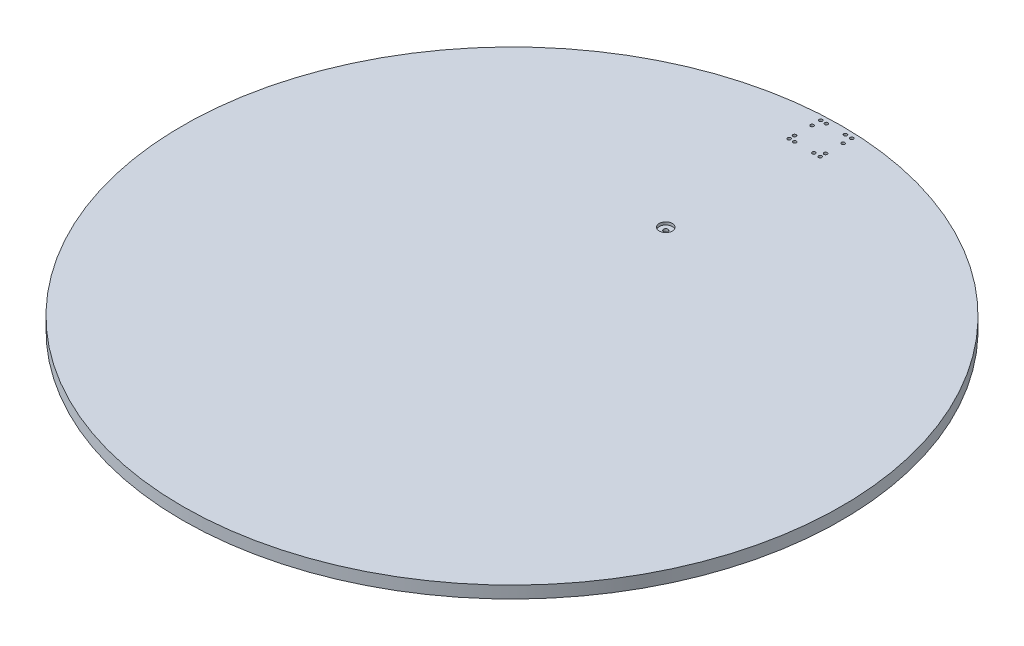
ISO-10303-21;
HEADER;
FILE_DESCRIPTION(('STEP AP214'),'2;1');
FILE_NAME('part.step','',(''),(''),'','','');
FILE_SCHEMA(('AUTOMOTIVE_DESIGN { 1 0 10303 214 1 1 1 1 }'));
ENDSEC;
DATA;
#1=APPLICATION_CONTEXT('core data for automotive mechanical design processes');
#2=APPLICATION_PROTOCOL_DEFINITION('international standard','automotive_design',2000,#1);
#3=PRODUCT_CONTEXT('',#1,'mechanical');
#4=PRODUCT('Part','Part','',(#3));
#5=PRODUCT_RELATED_PRODUCT_CATEGORY('part','',(#4));
#6=PRODUCT_DEFINITION_FORMATION('','',#4);
#7=PRODUCT_DEFINITION_CONTEXT('part definition',#1,'design');
#8=PRODUCT_DEFINITION('design','',#6,#7);
#9=PRODUCT_DEFINITION_SHAPE('','',#8);
#10=(LENGTH_UNIT() NAMED_UNIT(*) SI_UNIT(.MILLI.,.METRE.));
#11=(NAMED_UNIT(*) PLANE_ANGLE_UNIT() SI_UNIT($,.RADIAN.));
#12=(NAMED_UNIT(*) SI_UNIT($,.STERADIAN.) SOLID_ANGLE_UNIT());
#13=UNCERTAINTY_MEASURE_WITH_UNIT(LENGTH_MEASURE(1.E-05),#10,'distance_accuracy_value','');
#14=(GEOMETRIC_REPRESENTATION_CONTEXT(3) GLOBAL_UNCERTAINTY_ASSIGNED_CONTEXT((#13)) GLOBAL_UNIT_ASSIGNED_CONTEXT((#10,
#11,#12)) REPRESENTATION_CONTEXT('',''));
#15=CARTESIAN_POINT('',(0.,0.,0.));
#16=DIRECTION('',(0.,0.,1.));
#17=DIRECTION('',(1.,0.,0.));
#18=AXIS2_PLACEMENT_3D('',#15,#16,#17);
#19=CARTESIAN_POINT('',(1.28563826251593E-10,0.,-280.));
#20=DIRECTION('',(0.,1.,0.));
#21=DIRECTION('',(0.,0.,1.));
#22=AXIS2_PLACEMENT_3D('',#19,#20,#21);
#23=CYLINDRICAL_SURFACE('',#22,3.99999999999999);
#24=CARTESIAN_POINT('',(1.28563826251593E-10,8.,-280.));
#25=DIRECTION('',(0.,-1.,0.));
#26=DIRECTION('',(0.,0.,-1.));
#27=AXIS2_PLACEMENT_3D('',#24,#25,#26);
#28=CIRCLE('',#27,3.99999999999999);
#29=CARTESIAN_POINT('',(1.28563826251593E-10,8.,-284.));
#30=VERTEX_POINT('',#29);
#31=EDGE_CURVE('E133',#30,#30,#28,.F.);
#32=ORIENTED_EDGE('',*,*,#31,.F.);
#33=EDGE_LOOP('',(#32));
#34=FACE_BOUND('',#33,.T.);
#35=CARTESIAN_POINT('',(1.28563826251593E-10,17.,-280.));
#36=DIRECTION('',(0.,1.,0.));
#37=DIRECTION('',(0.,0.,1.));
#38=AXIS2_PLACEMENT_3D('',#35,#36,#37);
#39=CIRCLE('',#38,3.99999999999999);
#40=CARTESIAN_POINT('',(1.28563826251593E-10,17.,-276.));
#41=VERTEX_POINT('',#40);
#42=EDGE_CURVE('E37',#41,#41,#39,.F.);
#43=ORIENTED_EDGE('',*,*,#42,.F.);
#44=EDGE_LOOP('',(#43));
#45=FACE_BOUND('',#44,.T.);
#46=ADVANCED_FACE('F33',(#34,#45),#23,.F.);
#47=CARTESIAN_POINT('',(0.,22.,0.));
#48=DIRECTION('',(0.,-1.,0.));
#49=DIRECTION('',(0.,0.,-1.));
#50=AXIS2_PLACEMENT_3D('',#47,#48,#49);
#51=CYLINDRICAL_SURFACE('',#50,600.);
#52=CARTESIAN_POINT('',(0.,22.,0.));
#53=DIRECTION('',(0.,1.,0.));
#54=DIRECTION('',(0.,0.,1.));
#55=AXIS2_PLACEMENT_3D('',#52,#53,#54);
#56=CIRCLE('',#55,600.);
#57=CARTESIAN_POINT('',(0.,22.,600.));
#58=VERTEX_POINT('',#57);
#59=EDGE_CURVE('E11',#58,#58,#56,.T.);
#60=ORIENTED_EDGE('',*,*,#59,.F.);
#61=EDGE_LOOP('',(#60));
#62=FACE_BOUND('',#61,.T.);
#63=CARTESIAN_POINT('',(0.,0.,0.));
#64=DIRECTION('',(0.,1.,0.));
#65=DIRECTION('',(0.,0.,1.));
#66=AXIS2_PLACEMENT_3D('',#63,#64,#65);
#67=CIRCLE('',#66,600.);
#68=CARTESIAN_POINT('',(0.,0.,600.));
#69=VERTEX_POINT('',#68);
#70=EDGE_CURVE('E42',#69,#69,#67,.T.);
#71=ORIENTED_EDGE('',*,*,#70,.T.);
#72=EDGE_LOOP('',(#71));
#73=FACE_BOUND('',#72,.T.);
#74=ADVANCED_FACE('F35',(#62,#73),#51,.T.);
#75=CARTESIAN_POINT('',(0.,22.,0.));
#76=DIRECTION('',(0.,1.,0.));
#77=DIRECTION('',(0.,0.,1.));
#78=AXIS2_PLACEMENT_3D('',#75,#76,#77);
#79=PLANE('',#78);
#80=CARTESIAN_POINT('',(17.5875772330869,22.,-531.883070045424));
#81=DIRECTION('',(0.,1.,0.));
#82=DIRECTION('',(0.,0.,1.));
#83=AXIS2_PLACEMENT_3D('',#80,#81,#82);
#84=CIRCLE('',#83,3.);
#85=CARTESIAN_POINT('',(17.5875772330869,22.,-528.883070045424));
#86=VERTEX_POINT('',#85);
#87=EDGE_CURVE('E295',#86,#86,#84,.T.);
#88=ORIENTED_EDGE('',*,*,#87,.F.);
#89=EDGE_LOOP('',(#88));
#90=FACE_BOUND('',#89,.T.);
#91=CARTESIAN_POINT('',(29.1360242602252,22.,-531.883070045424));
#92=DIRECTION('',(0.,1.,0.));
#93=DIRECTION('',(0.,0.,1.));
#94=AXIS2_PLACEMENT_3D('',#91,#92,#93);
#95=CIRCLE('',#94,3.);
#96=CARTESIAN_POINT('',(29.1360242602252,22.,-528.883070045424));
#97=VERTEX_POINT('',#96);
#98=EDGE_CURVE('E291',#97,#97,#95,.T.);
#99=ORIENTED_EDGE('',*,*,#98,.F.);
#100=EDGE_LOOP('',(#99));
#101=FACE_BOUND('',#100,.T.);
#102=CARTESIAN_POINT('',(29.1360242602252,22.,-541.773153337076));
#103=DIRECTION('',(0.,1.,0.));
#104=DIRECTION('',(0.,0.,1.));
#105=AXIS2_PLACEMENT_3D('',#102,#103,#104);
#106=CIRCLE('',#105,3.);
#107=CARTESIAN_POINT('',(29.1360242602252,22.,-538.773153337076));
#108=VERTEX_POINT('',#107);
#109=EDGE_CURVE('E287',#108,#108,#106,.T.);
#110=ORIENTED_EDGE('',*,*,#109,.F.);
#111=EDGE_LOOP('',(#110));
#112=FACE_BOUND('',#111,.T.);
#113=CARTESIAN_POINT('',(29.1360242602252,22.,-573.664786381322));
#114=DIRECTION('',(0.,1.,0.));
#115=DIRECTION('',(0.,0.,1.));
#116=AXIS2_PLACEMENT_3D('',#113,#114,#115);
#117=CIRCLE('',#116,3.);
#118=CARTESIAN_POINT('',(29.1360242602252,22.,-570.664786381322));
#119=VERTEX_POINT('',#118);
#120=EDGE_CURVE('E283',#119,#119,#117,.T.);
#121=ORIENTED_EDGE('',*,*,#120,.F.);
#122=EDGE_LOOP('',(#121));
#123=FACE_BOUND('',#122,.T.);
#124=CARTESIAN_POINT('',(29.1360242602252,22.,-589.516341352475));
#125=DIRECTION('',(0.,1.,0.));
#126=DIRECTION('',(0.,0.,1.));
#127=AXIS2_PLACEMENT_3D('',#124,#125,#126);
#128=CIRCLE('',#127,3.);
#129=CARTESIAN_POINT('',(29.1360242602252,22.,-586.516341352475));
#130=VERTEX_POINT('',#129);
#131=EDGE_CURVE('E279',#130,#130,#128,.T.);
#132=ORIENTED_EDGE('',*,*,#131,.F.);
#133=EDGE_LOOP('',(#132));
#134=FACE_BOUND('',#133,.T.);
#135=CARTESIAN_POINT('',(17.5875772330869,22.,-589.516341352475));
#136=DIRECTION('',(0.,1.,0.));
#137=DIRECTION('',(0.,0.,1.));
#138=AXIS2_PLACEMENT_3D('',#135,#136,#137);
#139=CIRCLE('',#138,3.);
#140=CARTESIAN_POINT('',(17.5875772330869,22.,-586.516341352475));
#141=VERTEX_POINT('',#140);
#142=EDGE_CURVE('E275',#141,#141,#139,.T.);
#143=ORIENTED_EDGE('',*,*,#142,.F.);
#144=EDGE_LOOP('',(#143));
#145=FACE_BOUND('',#144,.T.);
#146=CARTESIAN_POINT('',(-17.3384223424247,22.,-589.516341352475));
#147=DIRECTION('',(0.,1.,0.));
#148=DIRECTION('',(0.,0.,1.));
#149=AXIS2_PLACEMENT_3D('',#146,#147,#148);
#150=CIRCLE('',#149,3.);
#151=CARTESIAN_POINT('',(-17.3384223424247,22.,-586.516341352475));
#152=VERTEX_POINT('',#151);
#153=EDGE_CURVE('E271',#152,#152,#150,.T.);
#154=ORIENTED_EDGE('',*,*,#153,.F.);
#155=EDGE_LOOP('',(#154));
#156=FACE_BOUND('',#155,.T.);
#157=CARTESIAN_POINT('',(-27.3597077913434,22.,-573.664786381322));
#158=DIRECTION('',(0.,1.,0.));
#159=DIRECTION('',(0.,0.,1.));
#160=AXIS2_PLACEMENT_3D('',#157,#158,#159);
#161=CIRCLE('',#160,3.);
#162=CARTESIAN_POINT('',(-27.3597077913434,22.,-570.664786381322));
#163=VERTEX_POINT('',#162);
#164=EDGE_CURVE('E267',#163,#163,#161,.T.);
#165=ORIENTED_EDGE('',*,*,#164,.F.);
#166=EDGE_LOOP('',(#165));
#167=FACE_BOUND('',#166,.T.);
#168=CARTESIAN_POINT('',(-27.3597077913434,22.,-589.516341352475));
#169=DIRECTION('',(0.,1.,0.));
#170=DIRECTION('',(0.,0.,1.));
#171=AXIS2_PLACEMENT_3D('',#168,#169,#170);
#172=CIRCLE('',#171,3.);
#173=CARTESIAN_POINT('',(-27.3597077913434,22.,-586.516341352475));
#174=VERTEX_POINT('',#173);
#175=EDGE_CURVE('E263',#174,#174,#172,.T.);
#176=ORIENTED_EDGE('',*,*,#175,.F.);
#177=EDGE_LOOP('',(#176));
#178=FACE_BOUND('',#177,.T.);
#179=CARTESIAN_POINT('',(-17.3384223424247,22.,-531.883070045424));
#180=DIRECTION('',(0.,1.,0.));
#181=DIRECTION('',(0.,0.,1.));
#182=AXIS2_PLACEMENT_3D('',#179,#180,#181);
#183=CIRCLE('',#182,3.);
#184=CARTESIAN_POINT('',(-17.3384223424247,22.,-528.883070045424));
#185=VERTEX_POINT('',#184);
#186=EDGE_CURVE('E259',#185,#185,#183,.T.);
#187=ORIENTED_EDGE('',*,*,#186,.F.);
#188=EDGE_LOOP('',(#187));
#189=FACE_BOUND('',#188,.T.);
#190=CARTESIAN_POINT('',(-27.3597077913434,22.,-531.883070045424));
#191=DIRECTION('',(0.,1.,0.));
#192=DIRECTION('',(0.,0.,1.));
#193=AXIS2_PLACEMENT_3D('',#190,#191,#192);
#194=CIRCLE('',#193,3.);
#195=CARTESIAN_POINT('',(-27.3597077913434,22.,-528.883070045424));
#196=VERTEX_POINT('',#195);
#197=EDGE_CURVE('E255',#196,#196,#194,.T.);
#198=ORIENTED_EDGE('',*,*,#197,.F.);
#199=EDGE_LOOP('',(#198));
#200=FACE_BOUND('',#199,.T.);
#201=CARTESIAN_POINT('',(-27.3597077913434,22.,-541.773153337076));
#202=DIRECTION('',(0.,1.,0.));
#203=DIRECTION('',(0.,0.,1.));
#204=AXIS2_PLACEMENT_3D('',#201,#202,#203);
#205=CIRCLE('',#204,3.);
#206=CARTESIAN_POINT('',(-27.3597077913434,22.,-538.773153337076));
#207=VERTEX_POINT('',#206);
#208=EDGE_CURVE('E159',#207,#207,#205,.T.);
#209=ORIENTED_EDGE('',*,*,#208,.F.);
#210=EDGE_LOOP('',(#209));
#211=FACE_BOUND('',#210,.T.);
#212=CARTESIAN_POINT('',(1.2756462552943E-10,22.,-280.));
#213=DIRECTION('',(0.,1.,0.));
#214=DIRECTION('',(0.,0.,1.));
#215=AXIS2_PLACEMENT_3D('',#212,#213,#214);
#216=CIRCLE('',#215,12.);
#217=CARTESIAN_POINT('',(1.2756462552943E-10,22.,-268.));
#218=VERTEX_POINT('',#217);
#219=EDGE_CURVE('E151',#218,#218,#216,.T.);
#220=ORIENTED_EDGE('',*,*,#219,.F.);
#221=EDGE_LOOP('',(#220));
#222=FACE_BOUND('',#221,.T.);
#223=ORIENTED_EDGE('',*,*,#59,.T.);
#224=EDGE_LOOP('',(#223));
#225=FACE_BOUND('',#224,.T.);
#226=ADVANCED_FACE('F198',(#90,#101,#112,#123,#134,#145,#156,#167,#178,#189,#200,#211,#222,
#225),#79,.T.);
#227=CARTESIAN_POINT('',(0.,0.,0.));
#228=DIRECTION('',(0.,1.,0.));
#229=DIRECTION('',(0.,0.,1.));
#230=AXIS2_PLACEMENT_3D('',#227,#228,#229);
#231=PLANE('',#230);
#232=CARTESIAN_POINT('',(17.5875772330869,0.,-531.883070045424));
#233=DIRECTION('',(0.,1.,0.));
#234=DIRECTION('',(0.,0.,1.));
#235=AXIS2_PLACEMENT_3D('',#232,#233,#234);
#236=CIRCLE('',#235,3.);
#237=CARTESIAN_POINT('',(17.5875772330869,0.,-528.883070045424));
#238=VERTEX_POINT('',#237);
#239=EDGE_CURVE('E209',#238,#238,#236,.T.);
#240=ORIENTED_EDGE('',*,*,#239,.T.);
#241=EDGE_LOOP('',(#240));
#242=FACE_BOUND('',#241,.T.);
#243=CARTESIAN_POINT('',(29.1360242602252,0.,-531.883070045424));
#244=DIRECTION('',(0.,1.,0.));
#245=DIRECTION('',(0.,0.,1.));
#246=AXIS2_PLACEMENT_3D('',#243,#244,#245);
#247=CIRCLE('',#246,3.);
#248=CARTESIAN_POINT('',(29.1360242602252,0.,-528.883070045424));
#249=VERTEX_POINT('',#248);
#250=EDGE_CURVE('E213',#249,#249,#247,.T.);
#251=ORIENTED_EDGE('',*,*,#250,.T.);
#252=EDGE_LOOP('',(#251));
#253=FACE_BOUND('',#252,.T.);
#254=CARTESIAN_POINT('',(29.1360242602252,0.,-541.773153337076));
#255=DIRECTION('',(0.,1.,0.));
#256=DIRECTION('',(0.,0.,1.));
#257=AXIS2_PLACEMENT_3D('',#254,#255,#256);
#258=CIRCLE('',#257,3.);
#259=CARTESIAN_POINT('',(29.1360242602252,0.,-538.773153337076));
#260=VERTEX_POINT('',#259);
#261=EDGE_CURVE('E217',#260,#260,#258,.T.);
#262=ORIENTED_EDGE('',*,*,#261,.T.);
#263=EDGE_LOOP('',(#262));
#264=FACE_BOUND('',#263,.T.);
#265=CARTESIAN_POINT('',(29.1360242602252,0.,-573.664786381322));
#266=DIRECTION('',(0.,1.,0.));
#267=DIRECTION('',(0.,0.,1.));
#268=AXIS2_PLACEMENT_3D('',#265,#266,#267);
#269=CIRCLE('',#268,3.);
#270=CARTESIAN_POINT('',(29.1360242602252,0.,-570.664786381322));
#271=VERTEX_POINT('',#270);
#272=EDGE_CURVE('E221',#271,#271,#269,.T.);
#273=ORIENTED_EDGE('',*,*,#272,.T.);
#274=EDGE_LOOP('',(#273));
#275=FACE_BOUND('',#274,.T.);
#276=CARTESIAN_POINT('',(29.1360242602252,0.,-589.516341352475));
#277=DIRECTION('',(0.,1.,0.));
#278=DIRECTION('',(0.,0.,1.));
#279=AXIS2_PLACEMENT_3D('',#276,#277,#278);
#280=CIRCLE('',#279,3.);
#281=CARTESIAN_POINT('',(29.1360242602252,0.,-586.516341352475));
#282=VERTEX_POINT('',#281);
#283=EDGE_CURVE('E225',#282,#282,#280,.T.);
#284=ORIENTED_EDGE('',*,*,#283,.T.);
#285=EDGE_LOOP('',(#284));
#286=FACE_BOUND('',#285,.T.);
#287=CARTESIAN_POINT('',(17.5875772330869,0.,-589.516341352475));
#288=DIRECTION('',(0.,1.,0.));
#289=DIRECTION('',(0.,0.,1.));
#290=AXIS2_PLACEMENT_3D('',#287,#288,#289);
#291=CIRCLE('',#290,3.);
#292=CARTESIAN_POINT('',(17.5875772330869,0.,-586.516341352475));
#293=VERTEX_POINT('',#292);
#294=EDGE_CURVE('E229',#293,#293,#291,.T.);
#295=ORIENTED_EDGE('',*,*,#294,.T.);
#296=EDGE_LOOP('',(#295));
#297=FACE_BOUND('',#296,.T.);
#298=CARTESIAN_POINT('',(-17.3384223424247,0.,-589.516341352475));
#299=DIRECTION('',(0.,1.,0.));
#300=DIRECTION('',(0.,0.,1.));
#301=AXIS2_PLACEMENT_3D('',#298,#299,#300);
#302=CIRCLE('',#301,3.);
#303=CARTESIAN_POINT('',(-17.3384223424247,0.,-586.516341352475));
#304=VERTEX_POINT('',#303);
#305=EDGE_CURVE('E233',#304,#304,#302,.T.);
#306=ORIENTED_EDGE('',*,*,#305,.T.);
#307=EDGE_LOOP('',(#306));
#308=FACE_BOUND('',#307,.T.);
#309=CARTESIAN_POINT('',(-27.3597077913434,0.,-573.664786381322));
#310=DIRECTION('',(0.,1.,0.));
#311=DIRECTION('',(0.,0.,1.));
#312=AXIS2_PLACEMENT_3D('',#309,#310,#311);
#313=CIRCLE('',#312,3.);
#314=CARTESIAN_POINT('',(-27.3597077913434,0.,-570.664786381322));
#315=VERTEX_POINT('',#314);
#316=EDGE_CURVE('E237',#315,#315,#313,.T.);
#317=ORIENTED_EDGE('',*,*,#316,.T.);
#318=EDGE_LOOP('',(#317));
#319=FACE_BOUND('',#318,.T.);
#320=CARTESIAN_POINT('',(-27.3597077913434,0.,-589.516341352475));
#321=DIRECTION('',(0.,1.,0.));
#322=DIRECTION('',(0.,0.,1.));
#323=AXIS2_PLACEMENT_3D('',#320,#321,#322);
#324=CIRCLE('',#323,3.);
#325=CARTESIAN_POINT('',(-27.3597077913434,0.,-586.516341352475));
#326=VERTEX_POINT('',#325);
#327=EDGE_CURVE('E241',#326,#326,#324,.T.);
#328=ORIENTED_EDGE('',*,*,#327,.T.);
#329=EDGE_LOOP('',(#328));
#330=FACE_BOUND('',#329,.T.);
#331=CARTESIAN_POINT('',(-17.3384223424247,0.,-531.883070045424));
#332=DIRECTION('',(0.,1.,0.));
#333=DIRECTION('',(0.,0.,1.));
#334=AXIS2_PLACEMENT_3D('',#331,#332,#333);
#335=CIRCLE('',#334,3.);
#336=CARTESIAN_POINT('',(-17.3384223424247,0.,-528.883070045424));
#337=VERTEX_POINT('',#336);
#338=EDGE_CURVE('E245',#337,#337,#335,.T.);
#339=ORIENTED_EDGE('',*,*,#338,.T.);
#340=EDGE_LOOP('',(#339));
#341=FACE_BOUND('',#340,.T.);
#342=CARTESIAN_POINT('',(-27.3597077913434,0.,-531.883070045424));
#343=DIRECTION('',(0.,1.,0.));
#344=DIRECTION('',(0.,0.,1.));
#345=AXIS2_PLACEMENT_3D('',#342,#343,#344);
#346=CIRCLE('',#345,3.);
#347=CARTESIAN_POINT('',(-27.3597077913434,0.,-528.883070045424));
#348=VERTEX_POINT('',#347);
#349=EDGE_CURVE('E249',#348,#348,#346,.T.);
#350=ORIENTED_EDGE('',*,*,#349,.T.);
#351=EDGE_LOOP('',(#350));
#352=FACE_BOUND('',#351,.T.);
#353=CARTESIAN_POINT('',(-27.3597077913434,0.,-541.773153337076));
#354=DIRECTION('',(0.,1.,0.));
#355=DIRECTION('',(0.,0.,1.));
#356=AXIS2_PLACEMENT_3D('',#353,#354,#355);
#357=CIRCLE('',#356,3.);
#358=CARTESIAN_POINT('',(-27.3597077913434,0.,-538.773153337076));
#359=VERTEX_POINT('',#358);
#360=EDGE_CURVE('E156',#359,#359,#357,.T.);
#361=ORIENTED_EDGE('',*,*,#360,.T.);
#362=EDGE_LOOP('',(#361));
#363=FACE_BOUND('',#362,.T.);
#364=DIRECTION('',(0.,0.,1.));
#365=VECTOR('',#364,1.);
#366=CARTESIAN_POINT('',(6.50000000012851,0.,-280.));
#367=LINE('',#366,#365);
#368=CARTESIAN_POINT('',(6.50000000012851,0.,-283.752776749733));
#369=VERTEX_POINT('',#368);
#370=CARTESIAN_POINT('',(6.50000000012851,0.,-276.247223250267));
#371=VERTEX_POINT('',#370);
#372=EDGE_CURVE('E118',#369,#371,#367,.T.);
#373=ORIENTED_EDGE('',*,*,#372,.F.);
#374=DIRECTION('',(0.866025403784441,0.,0.499999999999996));
#375=VECTOR('',#374,1.);
#376=CARTESIAN_POINT('',(3.25000000012843,0.,-285.629165124599));
#377=LINE('',#376,#375);
#378=CARTESIAN_POINT('',(1.28452803949131E-10,0.,-287.505553499465));
#379=VERTEX_POINT('',#378);
#380=EDGE_CURVE('E50',#379,#369,#377,.T.);
#381=ORIENTED_EDGE('',*,*,#380,.F.);
#382=DIRECTION('',(0.86602540378444,0.,-0.499999999999997));
#383=VECTOR('',#382,1.);
#384=CARTESIAN_POINT('',(-3.24999999987152,0.,-285.629165124599));
#385=LINE('',#384,#383);
#386=CARTESIAN_POINT('',(-6.49999999987155,0.,-283.752776749733));
#387=VERTEX_POINT('',#386);
#388=EDGE_CURVE('E128',#387,#379,#385,.T.);
#389=ORIENTED_EDGE('',*,*,#388,.F.);
#390=DIRECTION('',(0.,0.,-1.));
#391=VECTOR('',#390,1.);
#392=CARTESIAN_POINT('',(-6.49999999987155,0.,-280.));
#393=LINE('',#392,#391);
#394=CARTESIAN_POINT('',(-6.49999999987155,0.,-276.247223250267));
#395=VERTEX_POINT('',#394);
#396=EDGE_CURVE('E107',#395,#387,#393,.T.);
#397=ORIENTED_EDGE('',*,*,#396,.F.);
#398=DIRECTION('',(-0.866025403784437,0.,-0.500000000000002));
#399=VECTOR('',#398,1.);
#400=CARTESIAN_POINT('',(-3.24999999987152,0.,-274.370834875401));
#401=LINE('',#400,#399);
#402=CARTESIAN_POINT('',(1.28452803949131E-10,0.,-272.494446500535));
#403=VERTEX_POINT('',#402);
#404=EDGE_CURVE('E124',#403,#395,#401,.T.);
#405=ORIENTED_EDGE('',*,*,#404,.F.);
#406=DIRECTION('',(-0.86602540378444,0.,0.499999999999997));
#407=VECTOR('',#406,1.);
#408=CARTESIAN_POINT('',(3.25000000012843,0.,-274.370834875401));
#409=LINE('',#408,#407);
#410=EDGE_CURVE('E121',#371,#403,#409,.T.);
#411=ORIENTED_EDGE('',*,*,#410,.F.);
#412=EDGE_LOOP('',(#373,#381,#389,#397,#405,#411));
#413=FACE_BOUND('',#412,.T.);
#414=ORIENTED_EDGE('',*,*,#70,.F.);
#415=EDGE_LOOP('',(#414));
#416=FACE_BOUND('',#415,.T.);
#417=ADVANCED_FACE('F174',(#242,#253,#264,#275,#286,#297,#308,#319,#330,#341,#352,#363,#413,
#416),#231,.F.);
#418=CARTESIAN_POINT('',(0.,8.,0.));
#419=DIRECTION('',(0.,-1.,0.));
#420=DIRECTION('',(0.,0.,-1.));
#421=AXIS2_PLACEMENT_3D('',#418,#419,#420);
#422=PLANE('',#421);
#423=DIRECTION('',(0.,0.,1.));
#424=VECTOR('',#423,1.);
#425=CARTESIAN_POINT('',(6.50000000012851,8.,-283.752776749733));
#426=LINE('',#425,#424);
#427=CARTESIAN_POINT('',(6.50000000012851,8.,-283.752776749733));
#428=VERTEX_POINT('',#427);
#429=CARTESIAN_POINT('',(6.50000000012851,8.,-276.247223250267));
#430=VERTEX_POINT('',#429);
#431=EDGE_CURVE('E84',#428,#430,#426,.T.);
#432=ORIENTED_EDGE('',*,*,#431,.T.);
#433=DIRECTION('',(-0.866025403784441,0.,0.499999999999996));
#434=VECTOR('',#433,1.);
#435=CARTESIAN_POINT('',(6.50000000012851,8.,-276.247223250267));
#436=LINE('',#435,#434);
#437=CARTESIAN_POINT('',(1.28452803949131E-10,8.,-272.494446500535));
#438=VERTEX_POINT('',#437);
#439=EDGE_CURVE('E163',#430,#438,#436,.T.);
#440=ORIENTED_EDGE('',*,*,#439,.T.);
#441=DIRECTION('',(-0.86602540378444,0.,-0.499999999999997));
#442=VECTOR('',#441,1.);
#443=CARTESIAN_POINT('',(1.28452803949131E-10,8.,-272.494446500535));
#444=LINE('',#443,#442);
#445=CARTESIAN_POINT('',(-6.49999999987155,8.,-276.247223250267));
#446=VERTEX_POINT('',#445);
#447=EDGE_CURVE('E99',#438,#446,#444,.T.);
#448=ORIENTED_EDGE('',*,*,#447,.T.);
#449=DIRECTION('',(0.,0.,-1.));
#450=VECTOR('',#449,1.);
#451=CARTESIAN_POINT('',(-6.49999999987155,8.,-276.247223250267));
#452=LINE('',#451,#450);
#453=CARTESIAN_POINT('',(-6.49999999987155,8.,-283.752776749733));
#454=VERTEX_POINT('',#453);
#455=EDGE_CURVE('E92',#446,#454,#452,.T.);
#456=ORIENTED_EDGE('',*,*,#455,.T.);
#457=DIRECTION('',(0.866025403784437,0.,-0.500000000000002));
#458=VECTOR('',#457,1.);
#459=CARTESIAN_POINT('',(-6.49999999987155,8.,-283.752776749733));
#460=LINE('',#459,#458);
#461=CARTESIAN_POINT('',(1.28452803949131E-10,8.,-287.505553499465));
#462=VERTEX_POINT('',#461);
#463=EDGE_CURVE('E97',#454,#462,#460,.T.);
#464=ORIENTED_EDGE('',*,*,#463,.T.);
#465=DIRECTION('',(0.86602540378444,0.,0.499999999999997));
#466=VECTOR('',#465,1.);
#467=CARTESIAN_POINT('',(1.28452803949131E-10,8.,-287.505553499465));
#468=LINE('',#467,#466);
#469=EDGE_CURVE('E59',#462,#428,#468,.T.);
#470=ORIENTED_EDGE('',*,*,#469,.T.);
#471=EDGE_LOOP('',(#432,#440,#448,#456,#464,#470));
#472=FACE_BOUND('',#471,.T.);
#473=ORIENTED_EDGE('',*,*,#31,.T.);
#474=EDGE_LOOP('',(#473));
#475=FACE_BOUND('',#474,.T.);
#476=ADVANCED_FACE('F94',(#472,#475),#422,.T.);
#477=CARTESIAN_POINT('',(3.25000000012843,8.,-285.629165124599));
#478=DIRECTION('',(0.499999999999996,0.,-0.866025403784441));
#479=DIRECTION('',(-0.866025403784441,0.,-0.499999999999996));
#480=AXIS2_PLACEMENT_3D('',#477,#478,#479);
#481=PLANE('',#480);
#482=ORIENTED_EDGE('',*,*,#380,.T.);
#483=DIRECTION('',(0.,-1.,0.));
#484=VECTOR('',#483,1.);
#485=CARTESIAN_POINT('',(6.50000000012851,8.,-283.752776749733));
#486=LINE('',#485,#484);
#487=EDGE_CURVE('E131',#428,#369,#486,.T.);
#488=ORIENTED_EDGE('',*,*,#487,.F.);
#489=ORIENTED_EDGE('',*,*,#469,.F.);
#490=DIRECTION('',(0.,-1.,0.));
#491=VECTOR('',#490,1.);
#492=CARTESIAN_POINT('',(1.28452803949131E-10,8.,-287.505553499465));
#493=LINE('',#492,#491);
#494=EDGE_CURVE('E78',#462,#379,#493,.T.);
#495=ORIENTED_EDGE('',*,*,#494,.T.);
#496=EDGE_LOOP('',(#482,#488,#489,#495));
#497=FACE_BOUND('',#496,.T.);
#498=ADVANCED_FACE('F178',(#497),#481,.F.);
#499=CARTESIAN_POINT('',(-3.24999999987152,8.,-285.629165124599));
#500=DIRECTION('',(-0.499999999999997,0.,-0.86602540378444));
#501=DIRECTION('',(-0.86602540378444,0.,0.499999999999997));
#502=AXIS2_PLACEMENT_3D('',#499,#500,#501);
#503=PLANE('',#502);
#504=ORIENTED_EDGE('',*,*,#388,.T.);
#505=ORIENTED_EDGE('',*,*,#494,.F.);
#506=ORIENTED_EDGE('',*,*,#463,.F.);
#507=DIRECTION('',(0.,-1.,0.));
#508=VECTOR('',#507,1.);
#509=CARTESIAN_POINT('',(-6.49999999987155,8.,-283.752776749733));
#510=LINE('',#509,#508);
#511=EDGE_CURVE('E104',#454,#387,#510,.T.);
#512=ORIENTED_EDGE('',*,*,#511,.T.);
#513=EDGE_LOOP('',(#504,#505,#506,#512));
#514=FACE_BOUND('',#513,.T.);
#515=ADVANCED_FACE('F112',(#514),#503,.F.);
#516=CARTESIAN_POINT('',(-6.49999999987155,8.,-280.));
#517=DIRECTION('',(-1.,0.,0.));
#518=DIRECTION('',(0.,0.,1.));
#519=AXIS2_PLACEMENT_3D('',#516,#517,#518);
#520=PLANE('',#519);
#521=ORIENTED_EDGE('',*,*,#396,.T.);
#522=ORIENTED_EDGE('',*,*,#511,.F.);
#523=ORIENTED_EDGE('',*,*,#455,.F.);
#524=DIRECTION('',(0.,-1.,0.));
#525=VECTOR('',#524,1.);
#526=CARTESIAN_POINT('',(-6.49999999987155,8.,-276.247223250267));
#527=LINE('',#526,#525);
#528=EDGE_CURVE('E110',#446,#395,#527,.T.);
#529=ORIENTED_EDGE('',*,*,#528,.T.);
#530=EDGE_LOOP('',(#521,#522,#523,#529));
#531=FACE_BOUND('',#530,.T.);
#532=ADVANCED_FACE('F105',(#531),#520,.F.);
#533=CARTESIAN_POINT('',(-3.24999999987152,8.,-274.370834875401));
#534=DIRECTION('',(-0.500000000000002,0.,0.866025403784438));
#535=DIRECTION('',(0.866025403784437,0.,0.500000000000002));
#536=AXIS2_PLACEMENT_3D('',#533,#534,#535);
#537=PLANE('',#536);
#538=ORIENTED_EDGE('',*,*,#404,.T.);
#539=ORIENTED_EDGE('',*,*,#528,.F.);
#540=ORIENTED_EDGE('',*,*,#447,.F.);
#541=DIRECTION('',(0.,-1.,0.));
#542=VECTOR('',#541,1.);
#543=CARTESIAN_POINT('',(1.28452803949131E-10,8.,-272.494446500535));
#544=LINE('',#543,#542);
#545=EDGE_CURVE('E136',#438,#403,#544,.T.);
#546=ORIENTED_EDGE('',*,*,#545,.T.);
#547=EDGE_LOOP('',(#538,#539,#540,#546));
#548=FACE_BOUND('',#547,.T.);
#549=ADVANCED_FACE('F171',(#548),#537,.F.);
#550=CARTESIAN_POINT('',(3.25000000012843,8.,-274.370834875401));
#551=DIRECTION('',(0.499999999999997,0.,0.86602540378444));
#552=DIRECTION('',(0.86602540378444,0.,-0.499999999999997));
#553=AXIS2_PLACEMENT_3D('',#550,#551,#552);
#554=PLANE('',#553);
#555=ORIENTED_EDGE('',*,*,#410,.T.);
#556=ORIENTED_EDGE('',*,*,#545,.F.);
#557=ORIENTED_EDGE('',*,*,#439,.F.);
#558=DIRECTION('',(0.,-1.,0.));
#559=VECTOR('',#558,1.);
#560=CARTESIAN_POINT('',(6.50000000012851,8.,-276.247223250267));
#561=LINE('',#560,#559);
#562=EDGE_CURVE('E114',#430,#371,#561,.T.);
#563=ORIENTED_EDGE('',*,*,#562,.T.);
#564=EDGE_LOOP('',(#555,#556,#557,#563));
#565=FACE_BOUND('',#564,.T.);
#566=ADVANCED_FACE('F167',(#565),#554,.F.);
#567=CARTESIAN_POINT('',(6.50000000012851,8.,-280.));
#568=DIRECTION('',(1.,0.,0.));
#569=DIRECTION('',(0.,0.,-1.));
#570=AXIS2_PLACEMENT_3D('',#567,#568,#569);
#571=PLANE('',#570);
#572=ORIENTED_EDGE('',*,*,#372,.T.);
#573=ORIENTED_EDGE('',*,*,#562,.F.);
#574=ORIENTED_EDGE('',*,*,#431,.F.);
#575=ORIENTED_EDGE('',*,*,#487,.T.);
#576=EDGE_LOOP('',(#572,#573,#574,#575));
#577=FACE_BOUND('',#576,.T.);
#578=ADVANCED_FACE('F177',(#577),#571,.F.);
#579=CARTESIAN_POINT('',(1.2756462552943E-10,17.,-280.));
#580=DIRECTION('',(0.,1.,0.));
#581=DIRECTION('',(0.,0.,1.));
#582=AXIS2_PLACEMENT_3D('',#579,#580,#581);
#583=PLANE('',#582);
#584=CARTESIAN_POINT('',(1.2756462552943E-10,17.,-280.));
#585=DIRECTION('',(0.,1.,0.));
#586=DIRECTION('',(0.,0.,1.));
#587=AXIS2_PLACEMENT_3D('',#584,#585,#586);
#588=CIRCLE('',#587,12.);
#589=CARTESIAN_POINT('',(1.2756462552943E-10,17.,-268.));
#590=VERTEX_POINT('',#589);
#591=EDGE_CURVE('E149',#590,#590,#588,.T.);
#592=ORIENTED_EDGE('',*,*,#591,.T.);
#593=EDGE_LOOP('',(#592));
#594=FACE_BOUND('',#593,.T.);
#595=ORIENTED_EDGE('',*,*,#42,.T.);
#596=EDGE_LOOP('',(#595));
#597=FACE_BOUND('',#596,.T.);
#598=ADVANCED_FACE('F196',(#594,#597),#583,.T.);
#599=CARTESIAN_POINT('',(1.2756462552943E-10,17.,-280.));
#600=DIRECTION('',(0.,1.,0.));
#601=DIRECTION('',(0.,0.,1.));
#602=AXIS2_PLACEMENT_3D('',#599,#600,#601);
#603=CYLINDRICAL_SURFACE('',#602,12.);
#604=ORIENTED_EDGE('',*,*,#591,.F.);
#605=EDGE_LOOP('',(#604));
#606=FACE_BOUND('',#605,.T.);
#607=ORIENTED_EDGE('',*,*,#219,.T.);
#608=EDGE_LOOP('',(#607));
#609=FACE_BOUND('',#608,.T.);
#610=ADVANCED_FACE('F402',(#606,#609),#603,.F.);
#611=CARTESIAN_POINT('',(-27.3597077913434,0.,-541.773153337076));
#612=DIRECTION('',(0.,1.,0.));
#613=DIRECTION('',(0.,0.,1.));
#614=AXIS2_PLACEMENT_3D('',#611,#612,#613);
#615=CYLINDRICAL_SURFACE('',#614,3.);
#616=ORIENTED_EDGE('',*,*,#360,.F.);
#617=EDGE_LOOP('',(#616));
#618=FACE_BOUND('',#617,.T.);
#619=ORIENTED_EDGE('',*,*,#208,.T.);
#620=EDGE_LOOP('',(#619));
#621=FACE_BOUND('',#620,.T.);
#622=ADVANCED_FACE('F410',(#618,#621),#615,.F.);
#623=CARTESIAN_POINT('',(-27.3597077913434,0.,-531.883070045424));
#624=DIRECTION('',(0.,1.,0.));
#625=DIRECTION('',(0.,0.,1.));
#626=AXIS2_PLACEMENT_3D('',#623,#624,#625);
#627=CYLINDRICAL_SURFACE('',#626,3.);
#628=ORIENTED_EDGE('',*,*,#349,.F.);
#629=EDGE_LOOP('',(#628));
#630=FACE_BOUND('',#629,.T.);
#631=ORIENTED_EDGE('',*,*,#197,.T.);
#632=EDGE_LOOP('',(#631));
#633=FACE_BOUND('',#632,.T.);
#634=ADVANCED_FACE('F419',(#630,#633),#627,.F.);
#635=CARTESIAN_POINT('',(-17.3384223424247,0.,-531.883070045424));
#636=DIRECTION('',(0.,1.,0.));
#637=DIRECTION('',(0.,0.,1.));
#638=AXIS2_PLACEMENT_3D('',#635,#636,#637);
#639=CYLINDRICAL_SURFACE('',#638,3.);
#640=ORIENTED_EDGE('',*,*,#338,.F.);
#641=EDGE_LOOP('',(#640));
#642=FACE_BOUND('',#641,.T.);
#643=ORIENTED_EDGE('',*,*,#186,.T.);
#644=EDGE_LOOP('',(#643));
#645=FACE_BOUND('',#644,.T.);
#646=ADVANCED_FACE('F425',(#642,#645),#639,.F.);
#647=CARTESIAN_POINT('',(-27.3597077913434,0.,-589.516341352475));
#648=DIRECTION('',(0.,1.,0.));
#649=DIRECTION('',(0.,0.,1.));
#650=AXIS2_PLACEMENT_3D('',#647,#648,#649);
#651=CYLINDRICAL_SURFACE('',#650,3.);
#652=ORIENTED_EDGE('',*,*,#327,.F.);
#653=EDGE_LOOP('',(#652));
#654=FACE_BOUND('',#653,.T.);
#655=ORIENTED_EDGE('',*,*,#175,.T.);
#656=EDGE_LOOP('',(#655));
#657=FACE_BOUND('',#656,.T.);
#658=ADVANCED_FACE('F433',(#654,#657),#651,.F.);
#659=CARTESIAN_POINT('',(-27.3597077913434,0.,-573.664786381322));
#660=DIRECTION('',(0.,1.,0.));
#661=DIRECTION('',(0.,0.,1.));
#662=AXIS2_PLACEMENT_3D('',#659,#660,#661);
#663=CYLINDRICAL_SURFACE('',#662,3.);
#664=ORIENTED_EDGE('',*,*,#316,.F.);
#665=EDGE_LOOP('',(#664));
#666=FACE_BOUND('',#665,.T.);
#667=ORIENTED_EDGE('',*,*,#164,.T.);
#668=EDGE_LOOP('',(#667));
#669=FACE_BOUND('',#668,.T.);
#670=ADVANCED_FACE('F441',(#666,#669),#663,.F.);
#671=CARTESIAN_POINT('',(-17.3384223424247,0.,-589.516341352475));
#672=DIRECTION('',(0.,1.,0.));
#673=DIRECTION('',(0.,0.,1.));
#674=AXIS2_PLACEMENT_3D('',#671,#672,#673);
#675=CYLINDRICAL_SURFACE('',#674,3.);
#676=ORIENTED_EDGE('',*,*,#305,.F.);
#677=EDGE_LOOP('',(#676));
#678=FACE_BOUND('',#677,.T.);
#679=ORIENTED_EDGE('',*,*,#153,.T.);
#680=EDGE_LOOP('',(#679));
#681=FACE_BOUND('',#680,.T.);
#682=ADVANCED_FACE('F449',(#678,#681),#675,.F.);
#683=CARTESIAN_POINT('',(17.5875772330869,0.,-589.516341352475));
#684=DIRECTION('',(0.,1.,0.));
#685=DIRECTION('',(0.,0.,1.));
#686=AXIS2_PLACEMENT_3D('',#683,#684,#685);
#687=CYLINDRICAL_SURFACE('',#686,3.);
#688=ORIENTED_EDGE('',*,*,#294,.F.);
#689=EDGE_LOOP('',(#688));
#690=FACE_BOUND('',#689,.T.);
#691=ORIENTED_EDGE('',*,*,#142,.T.);
#692=EDGE_LOOP('',(#691));
#693=FACE_BOUND('',#692,.T.);
#694=ADVANCED_FACE('F457',(#690,#693),#687,.F.);
#695=CARTESIAN_POINT('',(29.1360242602252,0.,-589.516341352475));
#696=DIRECTION('',(0.,1.,0.));
#697=DIRECTION('',(0.,0.,1.));
#698=AXIS2_PLACEMENT_3D('',#695,#696,#697);
#699=CYLINDRICAL_SURFACE('',#698,3.);
#700=ORIENTED_EDGE('',*,*,#283,.F.);
#701=EDGE_LOOP('',(#700));
#702=FACE_BOUND('',#701,.T.);
#703=ORIENTED_EDGE('',*,*,#131,.T.);
#704=EDGE_LOOP('',(#703));
#705=FACE_BOUND('',#704,.T.);
#706=ADVANCED_FACE('F465',(#702,#705),#699,.F.);
#707=CARTESIAN_POINT('',(29.1360242602252,0.,-573.664786381322));
#708=DIRECTION('',(0.,1.,0.));
#709=DIRECTION('',(0.,0.,1.));
#710=AXIS2_PLACEMENT_3D('',#707,#708,#709);
#711=CYLINDRICAL_SURFACE('',#710,3.);
#712=ORIENTED_EDGE('',*,*,#272,.F.);
#713=EDGE_LOOP('',(#712));
#714=FACE_BOUND('',#713,.T.);
#715=ORIENTED_EDGE('',*,*,#120,.T.);
#716=EDGE_LOOP('',(#715));
#717=FACE_BOUND('',#716,.T.);
#718=ADVANCED_FACE('F473',(#714,#717),#711,.F.);
#719=CARTESIAN_POINT('',(29.1360242602252,0.,-541.773153337076));
#720=DIRECTION('',(0.,1.,0.));
#721=DIRECTION('',(0.,0.,1.));
#722=AXIS2_PLACEMENT_3D('',#719,#720,#721);
#723=CYLINDRICAL_SURFACE('',#722,3.);
#724=ORIENTED_EDGE('',*,*,#261,.F.);
#725=EDGE_LOOP('',(#724));
#726=FACE_BOUND('',#725,.T.);
#727=ORIENTED_EDGE('',*,*,#109,.T.);
#728=EDGE_LOOP('',(#727));
#729=FACE_BOUND('',#728,.T.);
#730=ADVANCED_FACE('F481',(#726,#729),#723,.F.);
#731=CARTESIAN_POINT('',(29.1360242602252,0.,-531.883070045424));
#732=DIRECTION('',(0.,1.,0.));
#733=DIRECTION('',(0.,0.,1.));
#734=AXIS2_PLACEMENT_3D('',#731,#732,#733);
#735=CYLINDRICAL_SURFACE('',#734,3.);
#736=ORIENTED_EDGE('',*,*,#250,.F.);
#737=EDGE_LOOP('',(#736));
#738=FACE_BOUND('',#737,.T.);
#739=ORIENTED_EDGE('',*,*,#98,.T.);
#740=EDGE_LOOP('',(#739));
#741=FACE_BOUND('',#740,.T.);
#742=ADVANCED_FACE('F489',(#738,#741),#735,.F.);
#743=CARTESIAN_POINT('',(17.5875772330869,0.,-531.883070045424));
#744=DIRECTION('',(0.,1.,0.));
#745=DIRECTION('',(0.,0.,1.));
#746=AXIS2_PLACEMENT_3D('',#743,#744,#745);
#747=CYLINDRICAL_SURFACE('',#746,3.);
#748=ORIENTED_EDGE('',*,*,#239,.F.);
#749=EDGE_LOOP('',(#748));
#750=FACE_BOUND('',#749,.T.);
#751=ORIENTED_EDGE('',*,*,#87,.T.);
#752=EDGE_LOOP('',(#751));
#753=FACE_BOUND('',#752,.T.);
#754=ADVANCED_FACE('F300',(#750,#753),#747,.F.);
#755=CLOSED_SHELL('',(#46,#74,#226,#417,#476,#498,#515,#532,#549,#566,#578,#598,#610,#622,#634,
#646,#658,#670,#682,#694,#706,#718,#730,#742,#754));
#756=MANIFOLD_SOLID_BREP('B2',#755);
#757=ADVANCED_BREP_SHAPE_REPRESENTATION('',(#18,#756),#14);
#758=SHAPE_DEFINITION_REPRESENTATION(#9,#757);
ENDSEC;
END-ISO-10303-21;
